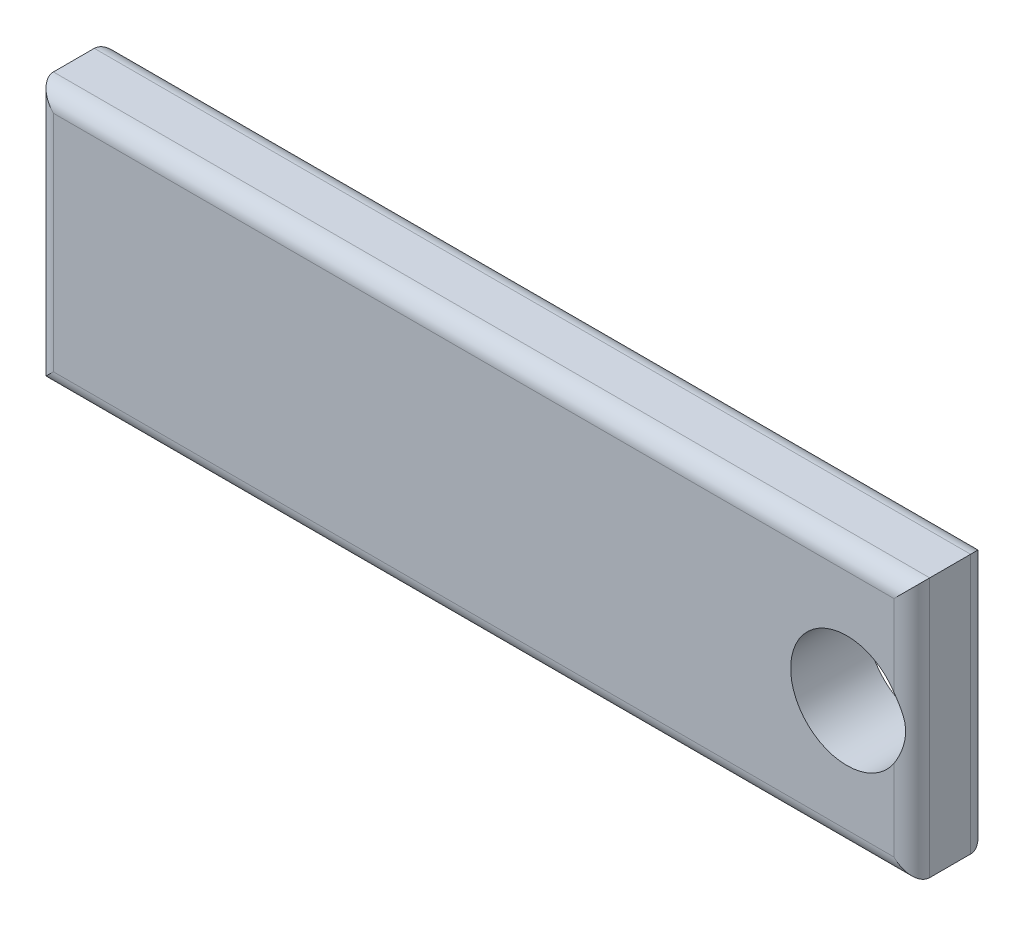
ISO-10303-21;
HEADER;
FILE_DESCRIPTION(('STEP AP214'),'2;1');
FILE_NAME('part.step','',(''),(''),'','','');
FILE_SCHEMA(('AUTOMOTIVE_DESIGN { 1 0 10303 214 1 1 1 1 }'));
ENDSEC;
DATA;
#1=APPLICATION_CONTEXT('core data for automotive mechanical design processes');
#2=APPLICATION_PROTOCOL_DEFINITION('international standard','automotive_design',2000,#1);
#3=PRODUCT_CONTEXT('',#1,'mechanical');
#4=PRODUCT('Part','Part','',(#3));
#5=PRODUCT_RELATED_PRODUCT_CATEGORY('part','',(#4));
#6=PRODUCT_DEFINITION_FORMATION('','',#4);
#7=PRODUCT_DEFINITION_CONTEXT('part definition',#1,'design');
#8=PRODUCT_DEFINITION('design','',#6,#7);
#9=PRODUCT_DEFINITION_SHAPE('','',#8);
#10=(LENGTH_UNIT() NAMED_UNIT(*) SI_UNIT(.MILLI.,.METRE.));
#11=(NAMED_UNIT(*) PLANE_ANGLE_UNIT() SI_UNIT($,.RADIAN.));
#12=(NAMED_UNIT(*) SI_UNIT($,.STERADIAN.) SOLID_ANGLE_UNIT());
#13=UNCERTAINTY_MEASURE_WITH_UNIT(LENGTH_MEASURE(1.E-05),#10,'distance_accuracy_value','');
#14=(GEOMETRIC_REPRESENTATION_CONTEXT(3) GLOBAL_UNCERTAINTY_ASSIGNED_CONTEXT((#13)) GLOBAL_UNIT_ASSIGNED_CONTEXT((#10,
#11,#12)) REPRESENTATION_CONTEXT('',''));
#15=CARTESIAN_POINT('',(0.,0.,0.));
#16=DIRECTION('',(0.,0.,1.));
#17=DIRECTION('',(1.,0.,0.));
#18=AXIS2_PLACEMENT_3D('',#15,#16,#17);
#19=CARTESIAN_POINT('',(0.,0.,3.));
#20=DIRECTION('',(0.,0.,1.));
#21=DIRECTION('',(1.,0.,0.));
#22=AXIS2_PLACEMENT_3D('',#19,#20,#21);
#23=PLANE('',#22);
#24=DIRECTION('',(1.,0.,0.));
#25=VECTOR('',#24,1.);
#26=CARTESIAN_POINT('',(34.29,0.7,3.));
#27=LINE('',#26,#25);
#28=CARTESIAN_POINT('',(0.7,0.7,3.));
#29=VERTEX_POINT('',#28);
#30=CARTESIAN_POINT('',(33.59,0.7,3.));
#31=VERTEX_POINT('',#30);
#32=EDGE_CURVE('E140',#29,#31,#27,.T.);
#33=ORIENTED_EDGE('',*,*,#32,.T.);
#34=DIRECTION('',(0.,1.,0.));
#35=VECTOR('',#34,1.);
#36=CARTESIAN_POINT('',(33.59,10.16,3.));
#37=LINE('',#36,#35);
#38=CARTESIAN_POINT('',(33.59,3.8740149254655,3.));
#39=VERTEX_POINT('',#38);
#40=EDGE_CURVE('E127',#31,#39,#37,.T.);
#41=ORIENTED_EDGE('',*,*,#40,.T.);
#42=CARTESIAN_POINT('',(31.75,5.08,3.));
#43=DIRECTION('',(0.,0.,1.));
#44=DIRECTION('',(1.,0.,0.));
#45=AXIS2_PLACEMENT_3D('',#42,#43,#44);
#46=CIRCLE('',#45,2.2);
#47=CARTESIAN_POINT('',(33.59,6.2859850745345,3.));
#48=VERTEX_POINT('',#47);
#49=EDGE_CURVE('E117',#48,#39,#46,.T.);
#50=ORIENTED_EDGE('',*,*,#49,.F.);
#51=DIRECTION('',(0.,1.,0.));
#52=VECTOR('',#51,1.);
#53=CARTESIAN_POINT('',(33.59,10.16,3.));
#54=LINE('',#53,#52);
#55=CARTESIAN_POINT('',(33.59,9.46,3.));
#56=VERTEX_POINT('',#55);
#57=EDGE_CURVE('E125',#48,#56,#54,.T.);
#58=ORIENTED_EDGE('',*,*,#57,.T.);
#59=DIRECTION('',(-1.,0.,0.));
#60=VECTOR('',#59,1.);
#61=CARTESIAN_POINT('',(0.,9.46,3.));
#62=LINE('',#61,#60);
#63=CARTESIAN_POINT('',(0.7,9.46,3.));
#64=VERTEX_POINT('',#63);
#65=EDGE_CURVE('E137',#56,#64,#62,.T.);
#66=ORIENTED_EDGE('',*,*,#65,.T.);
#67=DIRECTION('',(0.,-1.,0.));
#68=VECTOR('',#67,1.);
#69=CARTESIAN_POINT('',(0.7,0.,3.));
#70=LINE('',#69,#68);
#71=EDGE_CURVE('E136',#64,#29,#70,.T.);
#72=ORIENTED_EDGE('',*,*,#71,.T.);
#73=EDGE_LOOP('',(#33,#41,#50,#58,#66,#72));
#74=FACE_BOUND('',#73,.T.);
#75=ADVANCED_FACE('F32',(#74),#23,.T.);
#76=CARTESIAN_POINT('',(0.,0.,0.));
#77=DIRECTION('',(0.,0.,1.));
#78=DIRECTION('',(1.,0.,0.));
#79=AXIS2_PLACEMENT_3D('',#76,#77,#78);
#80=PLANE('',#79);
#81=CARTESIAN_POINT('',(31.75,5.08,0.));
#82=DIRECTION('',(0.,0.,1.));
#83=DIRECTION('',(1.,0.,0.));
#84=AXIS2_PLACEMENT_3D('',#81,#82,#83);
#85=CIRCLE('',#84,2.2);
#86=CARTESIAN_POINT('',(33.59,6.2859850745345,0.));
#87=VERTEX_POINT('',#86);
#88=CARTESIAN_POINT('',(33.59,3.8740149254655,0.));
#89=VERTEX_POINT('',#88);
#90=EDGE_CURVE('E129',#87,#89,#85,.T.);
#91=ORIENTED_EDGE('',*,*,#90,.T.);
#92=DIRECTION('',(0.,1.,0.));
#93=VECTOR('',#92,1.);
#94=CARTESIAN_POINT('',(33.59,0.,0.));
#95=LINE('',#94,#93);
#96=CARTESIAN_POINT('',(33.59,0.7,0.));
#97=VERTEX_POINT('',#96);
#98=EDGE_CURVE('E163',#89,#97,#95,.F.);
#99=ORIENTED_EDGE('',*,*,#98,.T.);
#100=DIRECTION('',(1.,0.,0.));
#101=VECTOR('',#100,1.);
#102=CARTESIAN_POINT('',(0.,0.7,0.));
#103=LINE('',#102,#101);
#104=CARTESIAN_POINT('',(0.7,0.7,0.));
#105=VERTEX_POINT('',#104);
#106=EDGE_CURVE('E161',#97,#105,#103,.F.);
#107=ORIENTED_EDGE('',*,*,#106,.T.);
#108=DIRECTION('',(0.,-1.,0.));
#109=VECTOR('',#108,1.);
#110=CARTESIAN_POINT('',(0.7,0.,0.));
#111=LINE('',#110,#109);
#112=CARTESIAN_POINT('',(0.7,9.46,0.));
#113=VERTEX_POINT('',#112);
#114=EDGE_CURVE('E158',#105,#113,#111,.F.);
#115=ORIENTED_EDGE('',*,*,#114,.T.);
#116=DIRECTION('',(-1.,0.,0.));
#117=VECTOR('',#116,1.);
#118=CARTESIAN_POINT('',(0.,9.46,0.));
#119=LINE('',#118,#117);
#120=CARTESIAN_POINT('',(33.59,9.46,0.));
#121=VERTEX_POINT('',#120);
#122=EDGE_CURVE('E154',#113,#121,#119,.F.);
#123=ORIENTED_EDGE('',*,*,#122,.T.);
#124=DIRECTION('',(0.,1.,0.));
#125=VECTOR('',#124,1.);
#126=CARTESIAN_POINT('',(33.59,0.,0.));
#127=LINE('',#126,#125);
#128=EDGE_CURVE('E156',#121,#87,#127,.F.);
#129=ORIENTED_EDGE('',*,*,#128,.T.);
#130=EDGE_LOOP('',(#91,#99,#107,#115,#123,#129));
#131=FACE_BOUND('',#130,.T.);
#132=ADVANCED_FACE('F201',(#131),#80,.F.);
#133=CARTESIAN_POINT('',(0.,10.16,3.));
#134=DIRECTION('',(1.,0.,0.));
#135=DIRECTION('',(0.,0.,-1.));
#136=AXIS2_PLACEMENT_3D('',#133,#134,#135);
#137=PLANE('',#136);
#138=DIRECTION('',(0.,0.,-1.));
#139=VECTOR('',#138,1.);
#140=CARTESIAN_POINT('',(0.,0.,3.));
#141=LINE('',#140,#139);
#142=CARTESIAN_POINT('',(0.,0.,2.3));
#143=VERTEX_POINT('',#142);
#144=CARTESIAN_POINT('',(0.,0.,0.7));
#145=VERTEX_POINT('',#144);
#146=EDGE_CURVE('E142',#143,#145,#141,.T.);
#147=ORIENTED_EDGE('',*,*,#146,.F.);
#148=DIRECTION('',(0.,-1.,0.));
#149=VECTOR('',#148,1.);
#150=CARTESIAN_POINT('',(0.,10.16,2.3));
#151=LINE('',#150,#149);
#152=CARTESIAN_POINT('',(0.,10.16,2.3));
#153=VERTEX_POINT('',#152);
#154=EDGE_CURVE('E151',#143,#153,#151,.F.);
#155=ORIENTED_EDGE('',*,*,#154,.T.);
#156=DIRECTION('',(0.,0.,-1.));
#157=VECTOR('',#156,1.);
#158=CARTESIAN_POINT('',(0.,10.16,3.));
#159=LINE('',#158,#157);
#160=CARTESIAN_POINT('',(0.,10.16,0.7));
#161=VERTEX_POINT('',#160);
#162=EDGE_CURVE('E128',#153,#161,#159,.T.);
#163=ORIENTED_EDGE('',*,*,#162,.T.);
#164=DIRECTION('',(0.,-1.,0.));
#165=VECTOR('',#164,1.);
#166=CARTESIAN_POINT('',(0.,10.16,0.7));
#167=LINE('',#166,#165);
#168=EDGE_CURVE('E148',#161,#145,#167,.T.);
#169=ORIENTED_EDGE('',*,*,#168,.T.);
#170=EDGE_LOOP('',(#147,#155,#163,#169));
#171=FACE_BOUND('',#170,.T.);
#172=ADVANCED_FACE('F205',(#171),#137,.F.);
#173=CARTESIAN_POINT('',(0.,0.,3.));
#174=DIRECTION('',(0.,1.,0.));
#175=DIRECTION('',(0.,0.,1.));
#176=AXIS2_PLACEMENT_3D('',#173,#174,#175);
#177=PLANE('',#176);
#178=ORIENTED_EDGE('',*,*,#146,.T.);
#179=DIRECTION('',(1.,0.,0.));
#180=VECTOR('',#179,1.);
#181=CARTESIAN_POINT('',(0.,0.,0.7));
#182=LINE('',#181,#180);
#183=CARTESIAN_POINT('',(34.29,0.,0.7));
#184=VERTEX_POINT('',#183);
#185=EDGE_CURVE('E50',#145,#184,#182,.T.);
#186=ORIENTED_EDGE('',*,*,#185,.T.);
#187=DIRECTION('',(0.,0.,-1.));
#188=VECTOR('',#187,1.);
#189=CARTESIAN_POINT('',(34.29,0.,3.));
#190=LINE('',#189,#188);
#191=CARTESIAN_POINT('',(34.29,0.,2.3));
#192=VERTEX_POINT('',#191);
#193=EDGE_CURVE('E275',#192,#184,#190,.T.);
#194=ORIENTED_EDGE('',*,*,#193,.F.);
#195=DIRECTION('',(1.,0.,0.));
#196=VECTOR('',#195,1.);
#197=CARTESIAN_POINT('',(0.,0.,2.3));
#198=LINE('',#197,#196);
#199=EDGE_CURVE('E236',#192,#143,#198,.F.);
#200=ORIENTED_EDGE('',*,*,#199,.T.);
#201=EDGE_LOOP('',(#178,#186,#194,#200));
#202=FACE_BOUND('',#201,.T.);
#203=ADVANCED_FACE('F216',(#202),#177,.F.);
#204=CARTESIAN_POINT('',(34.29,10.16,3.));
#205=DIRECTION('',(-1.,0.,0.));
#206=DIRECTION('',(0.,0.,1.));
#207=AXIS2_PLACEMENT_3D('',#204,#205,#206);
#208=PLANE('',#207);
#209=ORIENTED_EDGE('',*,*,#193,.T.);
#210=DIRECTION('',(0.,1.,0.));
#211=VECTOR('',#210,1.);
#212=CARTESIAN_POINT('',(34.29,10.16,0.7));
#213=LINE('',#212,#211);
#214=CARTESIAN_POINT('',(34.29,10.16,0.7));
#215=VERTEX_POINT('',#214);
#216=EDGE_CURVE('E122',#184,#215,#213,.T.);
#217=ORIENTED_EDGE('',*,*,#216,.T.);
#218=DIRECTION('',(0.,0.,-1.));
#219=VECTOR('',#218,1.);
#220=CARTESIAN_POINT('',(34.29,10.16,3.));
#221=LINE('',#220,#219);
#222=CARTESIAN_POINT('',(34.29,10.16,2.3));
#223=VERTEX_POINT('',#222);
#224=EDGE_CURVE('E273',#223,#215,#221,.T.);
#225=ORIENTED_EDGE('',*,*,#224,.F.);
#226=DIRECTION('',(0.,1.,0.));
#227=VECTOR('',#226,1.);
#228=CARTESIAN_POINT('',(34.29,0.,2.3));
#229=LINE('',#228,#227);
#230=EDGE_CURVE('E57',#223,#192,#229,.F.);
#231=ORIENTED_EDGE('',*,*,#230,.T.);
#232=EDGE_LOOP('',(#209,#217,#225,#231));
#233=FACE_BOUND('',#232,.T.);
#234=ADVANCED_FACE('F212',(#233),#208,.F.);
#235=CARTESIAN_POINT('',(0.,10.16,3.));
#236=DIRECTION('',(0.,-1.,0.));
#237=DIRECTION('',(1.,0.,0.));
#238=AXIS2_PLACEMENT_3D('',#235,#236,#237);
#239=PLANE('',#238);
#240=ORIENTED_EDGE('',*,*,#224,.T.);
#241=DIRECTION('',(-1.,0.,0.));
#242=VECTOR('',#241,1.);
#243=CARTESIAN_POINT('',(0.,10.16,0.7));
#244=LINE('',#243,#242);
#245=EDGE_CURVE('E11',#215,#161,#244,.T.);
#246=ORIENTED_EDGE('',*,*,#245,.T.);
#247=ORIENTED_EDGE('',*,*,#162,.F.);
#248=DIRECTION('',(-1.,0.,0.));
#249=VECTOR('',#248,1.);
#250=CARTESIAN_POINT('',(34.29,10.16,2.3));
#251=LINE('',#250,#249);
#252=EDGE_CURVE('E42',#153,#223,#251,.F.);
#253=ORIENTED_EDGE('',*,*,#252,.T.);
#254=EDGE_LOOP('',(#240,#246,#247,#253));
#255=FACE_BOUND('',#254,.T.);
#256=ADVANCED_FACE('F209',(#255),#239,.F.);
#257=CARTESIAN_POINT('',(31.75,5.08,3.));
#258=DIRECTION('',(0.,0.,-1.));
#259=DIRECTION('',(-1.,0.,0.));
#260=AXIS2_PLACEMENT_3D('',#257,#258,#259);
#261=CYLINDRICAL_SURFACE('',#260,2.2);
#262=ORIENTED_EDGE('',*,*,#49,.T.);
#263=CARTESIAN_POINT('',(33.59,3.8740149254655,3.));
#264=CARTESIAN_POINT('',(33.618625145815,3.91768027891798,2.99997811897689));
#265=CARTESIAN_POINT('',(33.6456572264547,3.9623224315398,2.99824659851657));
#266=CARTESIAN_POINT('',(33.6963912158137,4.05322803746823,2.99234330617165));
#267=CARTESIAN_POINT('',(33.7200979535674,4.09948901525687,2.98817511925217));
#268=CARTESIAN_POINT('',(33.7642267272342,4.19365348412075,2.97834838288962));
#269=CARTESIAN_POINT('',(33.7846325753644,4.24156375069108,2.97268282737167));
#270=CARTESIAN_POINT('',(33.8219855555729,4.33866173159117,2.96073270088249));
#271=CARTESIAN_POINT('',(33.8389310854888,4.38785002583313,2.95444784515654));
#272=CARTESIAN_POINT('',(33.8706005724759,4.49157863394793,2.94154529706951));
#273=CARTESIAN_POINT('',(33.8850110938277,4.54621719651126,2.9349450352971));
#274=CARTESIAN_POINT('',(33.9096056292871,4.65656433217957,2.92292868060046));
#275=CARTESIAN_POINT('',(33.9197901602679,4.71227277355707,2.91751244289876));
#276=CARTESIAN_POINT('',(33.9358134485422,4.82425528722597,2.90868483267292));
#277=CARTESIAN_POINT('',(33.941668894408,4.88052633082033,2.90526577187621));
#278=CARTESIAN_POINT('',(33.949024639487,4.99344868505145,2.90093267812367));
#279=CARTESIAN_POINT('',(33.9505253217397,5.050099961804,2.90001842484852));
#280=CARTESIAN_POINT('',(33.9491411734024,5.16407837747539,2.90084798592988));
#281=CARTESIAN_POINT('',(33.946198086136,5.22140454710854,2.90262711058783));
#282=CARTESIAN_POINT('',(33.935861398145,5.33552702958018,2.90861707630528));
#283=CARTESIAN_POINT('',(33.9284671324214,5.3923232619591,2.91282828070983));
#284=CARTESIAN_POINT('',(33.909279579985,5.50520877800607,2.92303953499983));
#285=CARTESIAN_POINT('',(33.8974704167814,5.56129474564087,2.92904602512037));
#286=CARTESIAN_POINT('',(33.8695467590157,5.67228078572393,2.94194210869795));
#287=CARTESIAN_POINT('',(33.8534320315564,5.72718079384745,2.94883174991601));
#288=CARTESIAN_POINT('',(33.8202748430272,5.82575785406209,2.96123162700964));
#289=CARTESIAN_POINT('',(33.8039284258318,5.86966743953619,2.96676579247169));
#290=CARTESIAN_POINT('',(33.7684409758462,5.95640802591885,2.97712641043308));
#291=CARTESIAN_POINT('',(33.7493012524295,5.99923952121716,2.98195319240821));
#292=CARTESIAN_POINT('',(33.7083488661085,6.08352037006531,2.99023863406857));
#293=CARTESIAN_POINT('',(33.6865482454266,6.12497494419484,2.99370317838903));
#294=CARTESIAN_POINT('',(33.6402632563404,6.20654842559917,2.99857781743124));
#295=CARTESIAN_POINT('',(33.6157754185837,6.24666551692809,2.99998522190564));
#296=CARTESIAN_POINT('',(33.59,6.2859850745345,3.));
#297=B_SPLINE_CURVE_WITH_KNOTS('',3,(#263,#264,#265,#266,#267,#268,#269,#270,#271,#272,#273,
#274,#275,#276,#277,#278,#279,#280,#281,#282,#283,#284,#285,#286,#287,#288,#289,#290,#291,#292,
#293,#294,#295,#296),.UNSPECIFIED.,.F.,.F.,(4,2,2,2,2,2,2,2,2,2,2,2,2,2,2,2,4),(0.,
0.156495532314654,0.312761396733278,0.46977177503971,0.626854686728539,0.797356376381305,
0.96783720613124,1.13765735768198,1.30746257161398,1.47951329829158,1.65158973545772,
1.82429102702419,1.9970016622595,2.13844683210921,2.27982591067233,2.42058736339719,
2.56153273427359),.UNSPECIFIED.);
#298=EDGE_CURVE('E113',#39,#48,#297,.T.);
#299=ORIENTED_EDGE('',*,*,#298,.T.);
#300=EDGE_LOOP('',(#262,#299));
#301=FACE_BOUND('',#300,.T.);
#302=ORIENTED_EDGE('',*,*,#90,.F.);
#303=CARTESIAN_POINT('',(33.59,6.2859850745345,0.));
#304=CARTESIAN_POINT('',(33.618625145815,6.24231972108203,2.1881023113688E-05));
#305=CARTESIAN_POINT('',(33.6456572264547,6.19767756846021,0.00175340148343325));
#306=CARTESIAN_POINT('',(33.6963912158137,6.10677196253177,0.00765669382835371));
#307=CARTESIAN_POINT('',(33.7200979535674,6.06051098474313,0.0118248807478323));
#308=CARTESIAN_POINT('',(33.7642267272342,5.96634651587925,0.021651617110381));
#309=CARTESIAN_POINT('',(33.7846325753644,5.91843624930893,0.0273171726283268));
#310=CARTESIAN_POINT('',(33.8219855555729,5.82133826840884,0.0392672991175137));
#311=CARTESIAN_POINT('',(33.8389310854888,5.77214997416688,0.0455521548434574));
#312=CARTESIAN_POINT('',(33.8706005724759,5.66842136605207,0.0584547029304923));
#313=CARTESIAN_POINT('',(33.8850110938277,5.61378280348874,0.0650549647028983));
#314=CARTESIAN_POINT('',(33.9096056292871,5.50343566782043,0.0770713193995409));
#315=CARTESIAN_POINT('',(33.9197901602679,5.44772722644293,0.0824875571012439));
#316=CARTESIAN_POINT('',(33.9358134485422,5.33574471277403,0.0913151673270758));
#317=CARTESIAN_POINT('',(33.941668894408,5.27947366917967,0.0947342281237872));
#318=CARTESIAN_POINT('',(33.949024639487,5.16655131494855,0.0990673218763343));
#319=CARTESIAN_POINT('',(33.9505253217397,5.10990003819601,0.0999815751514788));
#320=CARTESIAN_POINT('',(33.9491411734024,4.99592162252461,0.0991520140701164));
#321=CARTESIAN_POINT('',(33.946198086136,4.93859545289146,0.0973728894121688));
#322=CARTESIAN_POINT('',(33.935861398145,4.82447297041982,0.0913829236947231));
#323=CARTESIAN_POINT('',(33.9284671324214,4.7676767380409,0.0871717192901675));
#324=CARTESIAN_POINT('',(33.909279579985,4.65479122199393,0.0769604650001654));
#325=CARTESIAN_POINT('',(33.8974704167814,4.59870525435913,0.0709539748796298));
#326=CARTESIAN_POINT('',(33.8695467590157,4.48771921427608,0.0580578913020474));
#327=CARTESIAN_POINT('',(33.8534320315564,4.43281920615255,0.0511682500839871));
#328=CARTESIAN_POINT('',(33.8202748430272,4.33424214593791,0.0387683729903569));
#329=CARTESIAN_POINT('',(33.8039284258318,4.29033256046381,0.0332342075283144));
#330=CARTESIAN_POINT('',(33.7684409758462,4.20359197408115,0.022873589566917));
#331=CARTESIAN_POINT('',(33.7493012524295,4.16076047878285,0.0180468075917926));
#332=CARTESIAN_POINT('',(33.7083488661085,4.07647962993469,0.00976136593142669));
#333=CARTESIAN_POINT('',(33.6865482454266,4.03502505580517,0.00629682161097249));
#334=CARTESIAN_POINT('',(33.6402632563404,3.95345157440084,0.00142218256876256));
#335=CARTESIAN_POINT('',(33.6157754185837,3.91333448307192,1.47780943557296E-05));
#336=CARTESIAN_POINT('',(33.59,3.8740149254655,0.));
#337=B_SPLINE_CURVE_WITH_KNOTS('',3,(#303,#304,#305,#306,#307,#308,#309,#310,#311,#312,#313,
#314,#315,#316,#317,#318,#319,#320,#321,#322,#323,#324,#325,#326,#327,#328,#329,#330,#331,#332,
#333,#334,#335,#336),.UNSPECIFIED.,.F.,.F.,(4,2,2,2,2,2,2,2,2,2,2,2,2,2,2,2,4),(0.,
0.156495532314653,0.312761396733279,0.469771775039709,0.62685468672854,0.797356376381305,
0.967837206131241,1.13765735768198,1.30746257161398,1.47951329829158,1.65158973545772,
1.82429102702419,1.9970016622595,2.13844683210921,2.27982591067233,2.42058736339719,
2.56153273427359),.UNSPECIFIED.);
#338=EDGE_CURVE('E121',#87,#89,#337,.T.);
#339=ORIENTED_EDGE('',*,*,#338,.T.);
#340=EDGE_LOOP('',(#302,#339));
#341=FACE_BOUND('',#340,.T.);
#342=ADVANCED_FACE('F115',(#301,#341),#261,.F.);
#343=CARTESIAN_POINT('',(33.59,0.,2.3));
#344=DIRECTION('',(0.,-1.,0.));
#345=DIRECTION('',(0.,0.,-1.));
#346=AXIS2_PLACEMENT_3D('',#343,#344,#345);
#347=CYLINDRICAL_SURFACE('',#346,0.7);
#348=CARTESIAN_POINT('',(33.59,0.7,2.3));
#349=DIRECTION('',(-0.707106781186547,-0.707106781186547,0.));
#350=DIRECTION('',(-0.707106781186547,0.707106781186547,0.));
#351=AXIS2_PLACEMENT_3D('',#348,#349,#350);
#352=ELLIPSE('',#351,0.989949493661166,0.7);
#353=EDGE_CURVE('E234',#192,#31,#352,.T.);
#354=ORIENTED_EDGE('',*,*,#353,.F.);
#355=ORIENTED_EDGE('',*,*,#230,.F.);
#356=CARTESIAN_POINT('',(33.59,9.46,2.3));
#357=DIRECTION('',(0.707106781186547,-0.707106781186547,0.));
#358=DIRECTION('',(0.707106781186547,0.707106781186547,0.));
#359=AXIS2_PLACEMENT_3D('',#356,#357,#358);
#360=ELLIPSE('',#359,0.989949493661166,0.7);
#361=EDGE_CURVE('E134',#56,#223,#360,.F.);
#362=ORIENTED_EDGE('',*,*,#361,.F.);
#363=ORIENTED_EDGE('',*,*,#57,.F.);
#364=ORIENTED_EDGE('',*,*,#298,.F.);
#365=ORIENTED_EDGE('',*,*,#40,.F.);
#366=EDGE_LOOP('',(#354,#355,#362,#363,#364,#365));
#367=FACE_BOUND('',#366,.T.);
#368=ADVANCED_FACE('F132',(#367),#347,.T.);
#369=CARTESIAN_POINT('',(0.,9.46,2.3));
#370=DIRECTION('',(1.,0.,0.));
#371=DIRECTION('',(0.,1.,0.));
#372=AXIS2_PLACEMENT_3D('',#369,#370,#371);
#373=CYLINDRICAL_SURFACE('',#372,0.7);
#374=ORIENTED_EDGE('',*,*,#361,.T.);
#375=ORIENTED_EDGE('',*,*,#252,.F.);
#376=CARTESIAN_POINT('',(0.7,9.46,2.3));
#377=DIRECTION('',(0.707106781186547,0.707106781186547,0.));
#378=DIRECTION('',(0.707106781186547,-0.707106781186547,0.));
#379=AXIS2_PLACEMENT_3D('',#376,#377,#378);
#380=ELLIPSE('',#379,0.989949493661166,0.7);
#381=EDGE_CURVE('E237',#64,#153,#380,.F.);
#382=ORIENTED_EDGE('',*,*,#381,.F.);
#383=ORIENTED_EDGE('',*,*,#65,.F.);
#384=EDGE_LOOP('',(#374,#375,#382,#383));
#385=FACE_BOUND('',#384,.T.);
#386=ADVANCED_FACE('F182',(#385),#373,.T.);
#387=CARTESIAN_POINT('',(0.,0.7,2.3));
#388=DIRECTION('',(-1.,0.,0.));
#389=DIRECTION('',(0.,0.,1.));
#390=AXIS2_PLACEMENT_3D('',#387,#388,#389);
#391=CYLINDRICAL_SURFACE('',#390,0.7);
#392=ORIENTED_EDGE('',*,*,#353,.T.);
#393=ORIENTED_EDGE('',*,*,#32,.F.);
#394=CARTESIAN_POINT('',(0.7,0.7,2.3));
#395=DIRECTION('',(-0.707106781186547,0.707106781186547,0.));
#396=DIRECTION('',(-0.707106781186547,-0.707106781186547,0.));
#397=AXIS2_PLACEMENT_3D('',#394,#395,#396);
#398=ELLIPSE('',#397,0.989949493661166,0.7);
#399=EDGE_CURVE('E240',#143,#29,#398,.T.);
#400=ORIENTED_EDGE('',*,*,#399,.F.);
#401=ORIENTED_EDGE('',*,*,#199,.F.);
#402=EDGE_LOOP('',(#392,#393,#400,#401));
#403=FACE_BOUND('',#402,.T.);
#404=ADVANCED_FACE('F223',(#403),#391,.T.);
#405=CARTESIAN_POINT('',(0.7,0.,2.3));
#406=DIRECTION('',(0.,1.,0.));
#407=DIRECTION('',(0.,0.,1.));
#408=AXIS2_PLACEMENT_3D('',#405,#406,#407);
#409=CYLINDRICAL_SURFACE('',#408,0.7);
#410=ORIENTED_EDGE('',*,*,#381,.T.);
#411=ORIENTED_EDGE('',*,*,#154,.F.);
#412=ORIENTED_EDGE('',*,*,#399,.T.);
#413=ORIENTED_EDGE('',*,*,#71,.F.);
#414=EDGE_LOOP('',(#410,#411,#412,#413));
#415=FACE_BOUND('',#414,.T.);
#416=ADVANCED_FACE('F197',(#415),#409,.T.);
#417=CARTESIAN_POINT('',(33.59,10.16,0.7));
#418=DIRECTION('',(0.,1.,0.));
#419=DIRECTION('',(0.,0.,1.));
#420=AXIS2_PLACEMENT_3D('',#417,#418,#419);
#421=CYLINDRICAL_SURFACE('',#420,0.7);
#422=ORIENTED_EDGE('',*,*,#338,.F.);
#423=ORIENTED_EDGE('',*,*,#128,.F.);
#424=CARTESIAN_POINT('',(33.59,9.46,0.7));
#425=DIRECTION('',(-0.707106781186547,0.707106781186547,0.));
#426=DIRECTION('',(-0.707106781186547,-0.707106781186547,0.));
#427=AXIS2_PLACEMENT_3D('',#424,#425,#426);
#428=ELLIPSE('',#427,0.989949493661166,0.7);
#429=EDGE_CURVE('E37',#215,#121,#428,.T.);
#430=ORIENTED_EDGE('',*,*,#429,.F.);
#431=ORIENTED_EDGE('',*,*,#216,.F.);
#432=CARTESIAN_POINT('',(33.59,0.7,0.7));
#433=DIRECTION('',(0.707106781186547,0.707106781186547,0.));
#434=DIRECTION('',(0.707106781186547,-0.707106781186547,0.));
#435=AXIS2_PLACEMENT_3D('',#432,#433,#434);
#436=ELLIPSE('',#435,0.989949493661166,0.7);
#437=EDGE_CURVE('E247',#97,#184,#436,.F.);
#438=ORIENTED_EDGE('',*,*,#437,.F.);
#439=ORIENTED_EDGE('',*,*,#98,.F.);
#440=EDGE_LOOP('',(#422,#423,#430,#431,#438,#439));
#441=FACE_BOUND('',#440,.T.);
#442=ADVANCED_FACE('F34',(#441),#421,.T.);
#443=CARTESIAN_POINT('',(0.,9.46,0.7));
#444=DIRECTION('',(-1.,0.,0.));
#445=DIRECTION('',(0.,-1.,0.));
#446=AXIS2_PLACEMENT_3D('',#443,#444,#445);
#447=CYLINDRICAL_SURFACE('',#446,0.7);
#448=ORIENTED_EDGE('',*,*,#429,.T.);
#449=ORIENTED_EDGE('',*,*,#122,.F.);
#450=CARTESIAN_POINT('',(0.7,9.46,0.7));
#451=DIRECTION('',(-0.707106781186547,-0.707106781186547,0.));
#452=DIRECTION('',(-0.707106781186547,0.707106781186547,0.));
#453=AXIS2_PLACEMENT_3D('',#450,#451,#452);
#454=ELLIPSE('',#453,0.989949493661166,0.7);
#455=EDGE_CURVE('E246',#161,#113,#454,.T.);
#456=ORIENTED_EDGE('',*,*,#455,.F.);
#457=ORIENTED_EDGE('',*,*,#245,.F.);
#458=EDGE_LOOP('',(#448,#449,#456,#457));
#459=FACE_BOUND('',#458,.T.);
#460=ADVANCED_FACE('F190',(#459),#447,.T.);
#461=CARTESIAN_POINT('',(0.,0.7,0.7));
#462=DIRECTION('',(1.,0.,0.));
#463=DIRECTION('',(0.,0.,-1.));
#464=AXIS2_PLACEMENT_3D('',#461,#462,#463);
#465=CYLINDRICAL_SURFACE('',#464,0.7);
#466=ORIENTED_EDGE('',*,*,#437,.T.);
#467=ORIENTED_EDGE('',*,*,#185,.F.);
#468=CARTESIAN_POINT('',(0.7,0.7,0.7));
#469=DIRECTION('',(0.707106781186547,-0.707106781186547,0.));
#470=DIRECTION('',(0.707106781186547,0.707106781186547,0.));
#471=AXIS2_PLACEMENT_3D('',#468,#469,#470);
#472=ELLIPSE('',#471,0.989949493661166,0.7);
#473=EDGE_CURVE('E244',#105,#145,#472,.F.);
#474=ORIENTED_EDGE('',*,*,#473,.F.);
#475=ORIENTED_EDGE('',*,*,#106,.F.);
#476=EDGE_LOOP('',(#466,#467,#474,#475));
#477=FACE_BOUND('',#476,.T.);
#478=ADVANCED_FACE('F187',(#477),#465,.T.);
#479=CARTESIAN_POINT('',(0.7,10.16,0.7));
#480=DIRECTION('',(0.,-1.,0.));
#481=DIRECTION('',(0.,0.,-1.));
#482=AXIS2_PLACEMENT_3D('',#479,#480,#481);
#483=CYLINDRICAL_SURFACE('',#482,0.7);
#484=ORIENTED_EDGE('',*,*,#455,.T.);
#485=ORIENTED_EDGE('',*,*,#114,.F.);
#486=ORIENTED_EDGE('',*,*,#473,.T.);
#487=ORIENTED_EDGE('',*,*,#168,.F.);
#488=EDGE_LOOP('',(#484,#485,#486,#487));
#489=FACE_BOUND('',#488,.T.);
#490=ADVANCED_FACE('F184',(#489),#483,.T.);
#491=CLOSED_SHELL('',(#75,#132,#172,#203,#234,#256,#342,#368,#386,#404,#416,#442,#460,#478,#490));
#492=MANIFOLD_SOLID_BREP('B2',#491);
#493=ADVANCED_BREP_SHAPE_REPRESENTATION('',(#18,#492),#14);
#494=SHAPE_DEFINITION_REPRESENTATION(#9,#493);
ENDSEC;
END-ISO-10303-21;
